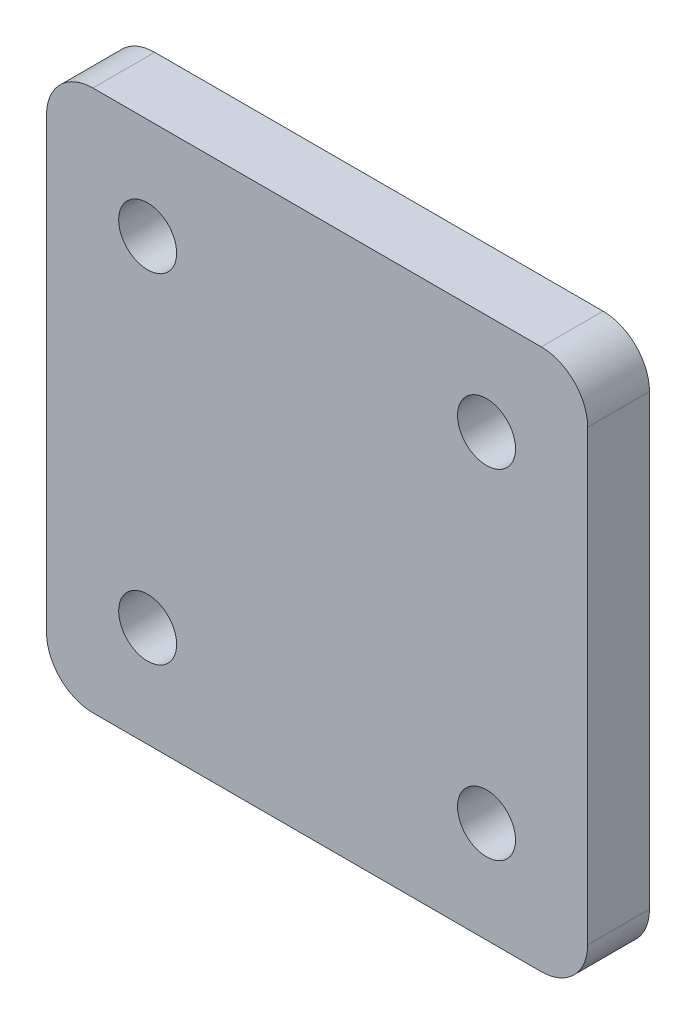
ISO-10303-21;
HEADER;
FILE_DESCRIPTION(('STEP AP214'),'2;1');
FILE_NAME('part.step','',(''),(''),'','','');
FILE_SCHEMA(('AUTOMOTIVE_DESIGN { 1 0 10303 214 1 1 1 1 }'));
ENDSEC;
DATA;
#1=APPLICATION_CONTEXT('core data for automotive mechanical design processes');
#2=APPLICATION_PROTOCOL_DEFINITION('international standard','automotive_design',2000,#1);
#3=PRODUCT_CONTEXT('',#1,'mechanical');
#4=PRODUCT('Part','Part','',(#3));
#5=PRODUCT_RELATED_PRODUCT_CATEGORY('part','',(#4));
#6=PRODUCT_DEFINITION_FORMATION('','',#4);
#7=PRODUCT_DEFINITION_CONTEXT('part definition',#1,'design');
#8=PRODUCT_DEFINITION('design','',#6,#7);
#9=PRODUCT_DEFINITION_SHAPE('','',#8);
#10=(LENGTH_UNIT() NAMED_UNIT(*) SI_UNIT(.MILLI.,.METRE.));
#11=(NAMED_UNIT(*) PLANE_ANGLE_UNIT() SI_UNIT($,.RADIAN.));
#12=(NAMED_UNIT(*) SI_UNIT($,.STERADIAN.) SOLID_ANGLE_UNIT());
#13=UNCERTAINTY_MEASURE_WITH_UNIT(LENGTH_MEASURE(1.E-05),#10,'distance_accuracy_value','');
#14=(GEOMETRIC_REPRESENTATION_CONTEXT(3) GLOBAL_UNCERTAINTY_ASSIGNED_CONTEXT((#13)) GLOBAL_UNIT_ASSIGNED_CONTEXT((#10,
#11,#12)) REPRESENTATION_CONTEXT('',''));
#15=CARTESIAN_POINT('',(0.,0.,0.));
#16=DIRECTION('',(0.,0.,1.));
#17=DIRECTION('',(1.,0.,0.));
#18=AXIS2_PLACEMENT_3D('',#15,#16,#17);
#19=CARTESIAN_POINT('',(-14.5000000000002,-14.5,4.));
#20=DIRECTION('',(0.,0.,-1.));
#21=DIRECTION('',(-1.,0.,0.));
#22=AXIS2_PLACEMENT_3D('',#19,#20,#21);
#23=CYLINDRICAL_SURFACE('',#22,3.);
#24=CARTESIAN_POINT('',(-14.5,-14.5,0.));
#25=DIRECTION('',(0.,0.,1.));
#26=DIRECTION('',(1.,0.,0.));
#27=AXIS2_PLACEMENT_3D('',#24,#25,#26);
#28=CIRCLE('',#27,3.);
#29=CARTESIAN_POINT('',(-17.5,-14.5,0.));
#30=VERTEX_POINT('',#29);
#31=CARTESIAN_POINT('',(-14.5,-17.5,0.));
#32=VERTEX_POINT('',#31);
#33=EDGE_CURVE('E132',#30,#32,#28,.T.);
#34=ORIENTED_EDGE('',*,*,#33,.T.);
#35=DIRECTION('',(0.,0.,-1.));
#36=VECTOR('',#35,1.);
#37=CARTESIAN_POINT('',(-14.5000000000002,-17.5,4.));
#38=LINE('',#37,#36);
#39=CARTESIAN_POINT('',(-14.5000000000002,-17.5,4.));
#40=VERTEX_POINT('',#39);
#41=EDGE_CURVE('E11',#40,#32,#38,.T.);
#42=ORIENTED_EDGE('',*,*,#41,.F.);
#43=CARTESIAN_POINT('',(-14.5000000000002,-14.5,4.));
#44=DIRECTION('',(0.,0.,1.));
#45=DIRECTION('',(1.,0.,0.));
#46=AXIS2_PLACEMENT_3D('',#43,#44,#45);
#47=CIRCLE('',#46,3.);
#48=CARTESIAN_POINT('',(-17.5000000000001,-14.5,4.));
#49=VERTEX_POINT('',#48);
#50=EDGE_CURVE('E147',#49,#40,#47,.T.);
#51=ORIENTED_EDGE('',*,*,#50,.F.);
#52=DIRECTION('',(0.,0.,-1.));
#53=VECTOR('',#52,1.);
#54=CARTESIAN_POINT('',(-17.5000000000001,-14.5,4.));
#55=LINE('',#54,#53);
#56=EDGE_CURVE('E128',#49,#30,#55,.T.);
#57=ORIENTED_EDGE('',*,*,#56,.T.);
#58=EDGE_LOOP('',(#34,#42,#51,#57));
#59=FACE_BOUND('',#58,.T.);
#60=ADVANCED_FACE('F36',(#59),#23,.T.);
#61=CARTESIAN_POINT('',(-14.5000000000002,-17.5,4.));
#62=DIRECTION('',(0.,1.,0.));
#63=DIRECTION('',(-1.,0.,0.));
#64=AXIS2_PLACEMENT_3D('',#61,#62,#63);
#65=PLANE('',#64);
#66=DIRECTION('',(1.,0.,0.));
#67=VECTOR('',#66,1.);
#68=CARTESIAN_POINT('',(-14.5,-17.5,0.));
#69=LINE('',#68,#67);
#70=CARTESIAN_POINT('',(14.5,-17.5,0.));
#71=VERTEX_POINT('',#70);
#72=EDGE_CURVE('E135',#32,#71,#69,.T.);
#73=ORIENTED_EDGE('',*,*,#72,.T.);
#74=DIRECTION('',(0.,0.,-1.));
#75=VECTOR('',#74,1.);
#76=CARTESIAN_POINT('',(14.4999999999998,-17.5,3.99999999999999));
#77=LINE('',#76,#75);
#78=CARTESIAN_POINT('',(14.4999999999998,-17.5,3.99999999999999));
#79=VERTEX_POINT('',#78);
#80=EDGE_CURVE('E44',#79,#71,#77,.T.);
#81=ORIENTED_EDGE('',*,*,#80,.F.);
#82=DIRECTION('',(1.,0.,0.));
#83=VECTOR('',#82,1.);
#84=CARTESIAN_POINT('',(-14.5000000000002,-17.5,4.));
#85=LINE('',#84,#83);
#86=EDGE_CURVE('E95',#40,#79,#85,.T.);
#87=ORIENTED_EDGE('',*,*,#86,.F.);
#88=ORIENTED_EDGE('',*,*,#41,.T.);
#89=EDGE_LOOP('',(#73,#81,#87,#88));
#90=FACE_BOUND('',#89,.T.);
#91=ADVANCED_FACE('F228',(#90),#65,.F.);
#92=CARTESIAN_POINT('',(14.4999999999998,-14.5,3.99999999999996));
#93=DIRECTION('',(0.,0.,-1.));
#94=DIRECTION('',(-1.,0.,0.));
#95=AXIS2_PLACEMENT_3D('',#92,#93,#94);
#96=CYLINDRICAL_SURFACE('',#95,3.);
#97=CARTESIAN_POINT('',(14.5,-14.5,0.));
#98=DIRECTION('',(0.,0.,1.));
#99=DIRECTION('',(1.,0.,0.));
#100=AXIS2_PLACEMENT_3D('',#97,#98,#99);
#101=CIRCLE('',#100,3.);
#102=CARTESIAN_POINT('',(17.5,-14.5,0.));
#103=VERTEX_POINT('',#102);
#104=EDGE_CURVE('E138',#71,#103,#101,.T.);
#105=ORIENTED_EDGE('',*,*,#104,.T.);
#106=DIRECTION('',(0.,0.,-1.));
#107=VECTOR('',#106,1.);
#108=CARTESIAN_POINT('',(17.4999999999999,-14.5,3.99999999999996));
#109=LINE('',#108,#107);
#110=CARTESIAN_POINT('',(17.4999999999999,-14.5,3.99999999999996));
#111=VERTEX_POINT('',#110);
#112=EDGE_CURVE('E154',#111,#103,#109,.T.);
#113=ORIENTED_EDGE('',*,*,#112,.F.);
#114=CARTESIAN_POINT('',(14.4999999999998,-14.5,3.99999999999996));
#115=DIRECTION('',(0.,0.,1.));
#116=DIRECTION('',(1.,0.,0.));
#117=AXIS2_PLACEMENT_3D('',#114,#115,#116);
#118=CIRCLE('',#117,3.);
#119=EDGE_CURVE('E162',#79,#111,#118,.T.);
#120=ORIENTED_EDGE('',*,*,#119,.F.);
#121=ORIENTED_EDGE('',*,*,#80,.T.);
#122=EDGE_LOOP('',(#105,#113,#120,#121));
#123=FACE_BOUND('',#122,.T.);
#124=ADVANCED_FACE('F160',(#123),#96,.T.);
#125=CARTESIAN_POINT('',(17.4999999999999,-14.5,3.99999999999996));
#126=DIRECTION('',(-1.,0.,0.));
#127=DIRECTION('',(0.,0.,1.));
#128=AXIS2_PLACEMENT_3D('',#125,#126,#127);
#129=PLANE('',#128);
#130=DIRECTION('',(0.,1.,0.));
#131=VECTOR('',#130,1.);
#132=CARTESIAN_POINT('',(17.5,-14.5,0.));
#133=LINE('',#132,#131);
#134=CARTESIAN_POINT('',(17.5,14.5,0.));
#135=VERTEX_POINT('',#134);
#136=EDGE_CURVE('E140',#103,#135,#133,.T.);
#137=ORIENTED_EDGE('',*,*,#136,.T.);
#138=DIRECTION('',(0.,0.,-1.));
#139=VECTOR('',#138,1.);
#140=CARTESIAN_POINT('',(17.4999999999999,14.5,3.99999999999998));
#141=LINE('',#140,#139);
#142=CARTESIAN_POINT('',(17.4999999999999,14.5,3.99999999999998));
#143=VERTEX_POINT('',#142);
#144=EDGE_CURVE('E151',#143,#135,#141,.T.);
#145=ORIENTED_EDGE('',*,*,#144,.F.);
#146=DIRECTION('',(0.,1.,0.));
#147=VECTOR('',#146,1.);
#148=CARTESIAN_POINT('',(17.4999999999999,-14.5,3.99999999999996));
#149=LINE('',#148,#147);
#150=EDGE_CURVE('E174',#111,#143,#149,.T.);
#151=ORIENTED_EDGE('',*,*,#150,.F.);
#152=ORIENTED_EDGE('',*,*,#112,.T.);
#153=EDGE_LOOP('',(#137,#145,#151,#152));
#154=FACE_BOUND('',#153,.T.);
#155=ADVANCED_FACE('F170',(#154),#129,.F.);
#156=CARTESIAN_POINT('',(14.4999999999998,14.5,3.99999999999998));
#157=DIRECTION('',(0.,0.,-1.));
#158=DIRECTION('',(-1.,0.,0.));
#159=AXIS2_PLACEMENT_3D('',#156,#157,#158);
#160=CYLINDRICAL_SURFACE('',#159,3.);
#161=CARTESIAN_POINT('',(14.5,14.5,0.));
#162=DIRECTION('',(0.,0.,1.));
#163=DIRECTION('',(1.,0.,0.));
#164=AXIS2_PLACEMENT_3D('',#161,#162,#163);
#165=CIRCLE('',#164,3.);
#166=CARTESIAN_POINT('',(14.4999999999998,17.5,0.));
#167=VERTEX_POINT('',#166);
#168=EDGE_CURVE('E142',#135,#167,#165,.T.);
#169=ORIENTED_EDGE('',*,*,#168,.T.);
#170=DIRECTION('',(0.,0.,-1.));
#171=VECTOR('',#170,1.);
#172=CARTESIAN_POINT('',(14.4999999999997,17.5,3.99999999999998));
#173=LINE('',#172,#171);
#174=CARTESIAN_POINT('',(14.4999999999997,17.5,3.99999999999998));
#175=VERTEX_POINT('',#174);
#176=EDGE_CURVE('E123',#175,#167,#173,.T.);
#177=ORIENTED_EDGE('',*,*,#176,.F.);
#178=CARTESIAN_POINT('',(14.4999999999998,14.5,3.99999999999998));
#179=DIRECTION('',(0.,0.,1.));
#180=DIRECTION('',(1.,0.,0.));
#181=AXIS2_PLACEMENT_3D('',#178,#179,#180);
#182=CIRCLE('',#181,3.);
#183=EDGE_CURVE('E114',#143,#175,#182,.T.);
#184=ORIENTED_EDGE('',*,*,#183,.F.);
#185=ORIENTED_EDGE('',*,*,#144,.T.);
#186=EDGE_LOOP('',(#169,#177,#184,#185));
#187=FACE_BOUND('',#186,.T.);
#188=ADVANCED_FACE('F173',(#187),#160,.T.);
#189=CARTESIAN_POINT('',(14.4999999999997,17.5,3.99999999999998));
#190=DIRECTION('',(0.,-1.,0.));
#191=DIRECTION('',(1.,0.,0.));
#192=AXIS2_PLACEMENT_3D('',#189,#190,#191);
#193=PLANE('',#192);
#194=DIRECTION('',(-1.,0.,0.));
#195=VECTOR('',#194,1.);
#196=CARTESIAN_POINT('',(14.4999999999998,17.5,0.));
#197=LINE('',#196,#195);
#198=CARTESIAN_POINT('',(-14.5000000000002,17.5,0.));
#199=VERTEX_POINT('',#198);
#200=EDGE_CURVE('E122',#167,#199,#197,.T.);
#201=ORIENTED_EDGE('',*,*,#200,.T.);
#202=DIRECTION('',(0.,0.,-1.));
#203=VECTOR('',#202,1.);
#204=CARTESIAN_POINT('',(-14.5000000000003,17.5,4.00000000000002));
#205=LINE('',#204,#203);
#206=CARTESIAN_POINT('',(-14.5000000000003,17.5,4.00000000000002));
#207=VERTEX_POINT('',#206);
#208=EDGE_CURVE('E119',#207,#199,#205,.T.);
#209=ORIENTED_EDGE('',*,*,#208,.F.);
#210=DIRECTION('',(-1.,0.,0.));
#211=VECTOR('',#210,1.);
#212=CARTESIAN_POINT('',(14.4999999999997,17.5,3.99999999999998));
#213=LINE('',#212,#211);
#214=EDGE_CURVE('E108',#175,#207,#213,.T.);
#215=ORIENTED_EDGE('',*,*,#214,.F.);
#216=ORIENTED_EDGE('',*,*,#176,.T.);
#217=EDGE_LOOP('',(#201,#209,#215,#216));
#218=FACE_BOUND('',#217,.T.);
#219=ADVANCED_FACE('F120',(#218),#193,.F.);
#220=CARTESIAN_POINT('',(-14.5000000000001,14.5,3.99999999999999));
#221=DIRECTION('',(0.,0.,-1.));
#222=DIRECTION('',(-1.,0.,0.));
#223=AXIS2_PLACEMENT_3D('',#220,#221,#222);
#224=CYLINDRICAL_SURFACE('',#223,3.);
#225=CARTESIAN_POINT('',(-14.5,14.5,0.));
#226=DIRECTION('',(0.,0.,1.));
#227=DIRECTION('',(1.,0.,0.));
#228=AXIS2_PLACEMENT_3D('',#225,#226,#227);
#229=CIRCLE('',#228,3.);
#230=CARTESIAN_POINT('',(-17.5,14.5,0.));
#231=VERTEX_POINT('',#230);
#232=EDGE_CURVE('E81',#199,#231,#229,.T.);
#233=ORIENTED_EDGE('',*,*,#232,.T.);
#234=DIRECTION('',(0.,0.,-1.));
#235=VECTOR('',#234,1.);
#236=CARTESIAN_POINT('',(-17.5000000000001,14.5,3.99999999999999));
#237=LINE('',#236,#235);
#238=CARTESIAN_POINT('',(-17.5000000000001,14.5,3.99999999999999));
#239=VERTEX_POINT('',#238);
#240=EDGE_CURVE('E124',#239,#231,#237,.T.);
#241=ORIENTED_EDGE('',*,*,#240,.F.);
#242=CARTESIAN_POINT('',(-14.5000000000001,14.5,3.99999999999999));
#243=DIRECTION('',(0.,0.,1.));
#244=DIRECTION('',(1.,0.,0.));
#245=AXIS2_PLACEMENT_3D('',#242,#243,#244);
#246=CIRCLE('',#245,3.);
#247=EDGE_CURVE('E112',#207,#239,#246,.T.);
#248=ORIENTED_EDGE('',*,*,#247,.F.);
#249=ORIENTED_EDGE('',*,*,#208,.T.);
#250=EDGE_LOOP('',(#233,#241,#248,#249));
#251=FACE_BOUND('',#250,.T.);
#252=ADVANCED_FACE('F126',(#251),#224,.T.);
#253=CARTESIAN_POINT('',(-17.5000000000001,14.5,3.99999999999999));
#254=DIRECTION('',(1.,0.,0.));
#255=DIRECTION('',(0.,0.,-1.));
#256=AXIS2_PLACEMENT_3D('',#253,#254,#255);
#257=PLANE('',#256);
#258=DIRECTION('',(0.,-1.,0.));
#259=VECTOR('',#258,1.);
#260=CARTESIAN_POINT('',(-17.5,14.5,0.));
#261=LINE('',#260,#259);
#262=EDGE_CURVE('E87',#231,#30,#261,.T.);
#263=ORIENTED_EDGE('',*,*,#262,.T.);
#264=ORIENTED_EDGE('',*,*,#56,.F.);
#265=DIRECTION('',(0.,-1.,0.));
#266=VECTOR('',#265,1.);
#267=CARTESIAN_POINT('',(-17.5000000000001,14.5,3.99999999999999));
#268=LINE('',#267,#266);
#269=EDGE_CURVE('E52',#239,#49,#268,.T.);
#270=ORIENTED_EDGE('',*,*,#269,.F.);
#271=ORIENTED_EDGE('',*,*,#240,.T.);
#272=EDGE_LOOP('',(#263,#264,#270,#271));
#273=FACE_BOUND('',#272,.T.);
#274=ADVANCED_FACE('F235',(#273),#257,.F.);
#275=CARTESIAN_POINT('',(-14.5000000000002,-14.5,4.));
#276=DIRECTION('',(0.,0.,1.));
#277=DIRECTION('',(1.,0.,0.));
#278=AXIS2_PLACEMENT_3D('',#275,#276,#277);
#279=PLANE('',#278);
#280=CARTESIAN_POINT('',(10.9601551083913,10.9601551083915,3.99999999999999));
#281=DIRECTION('',(0.,0.,1.));
#282=DIRECTION('',(1.,0.,0.));
#283=AXIS2_PLACEMENT_3D('',#280,#281,#282);
#284=CIRCLE('',#283,1.875);
#285=CARTESIAN_POINT('',(12.8351551083913,10.9601551083915,3.99999999999999));
#286=VERTEX_POINT('',#285);
#287=EDGE_CURVE('E197',#286,#286,#284,.T.);
#288=ORIENTED_EDGE('',*,*,#287,.F.);
#289=EDGE_LOOP('',(#288));
#290=FACE_BOUND('',#289,.T.);
#291=CARTESIAN_POINT('',(-10.9601551083917,10.9601551083915,4.00000000000002));
#292=DIRECTION('',(0.,0.,1.));
#293=DIRECTION('',(1.,0.,0.));
#294=AXIS2_PLACEMENT_3D('',#291,#292,#293);
#295=CIRCLE('',#294,1.87499999999999);
#296=CARTESIAN_POINT('',(-9.08515510839166,10.9601551083915,4.00000000000002));
#297=VERTEX_POINT('',#296);
#298=EDGE_CURVE('E191',#297,#297,#295,.T.);
#299=ORIENTED_EDGE('',*,*,#298,.F.);
#300=EDGE_LOOP('',(#299));
#301=FACE_BOUND('',#300,.T.);
#302=CARTESIAN_POINT('',(-10.9601551083917,-10.9601551083915,4.00000000000007));
#303=DIRECTION('',(0.,0.,1.));
#304=DIRECTION('',(1.,0.,0.));
#305=AXIS2_PLACEMENT_3D('',#302,#303,#304);
#306=CIRCLE('',#305,1.87499999999999);
#307=CARTESIAN_POINT('',(-9.08515510839166,-10.9601551083915,4.00000000000007));
#308=VERTEX_POINT('',#307);
#309=EDGE_CURVE('E185',#308,#308,#306,.T.);
#310=ORIENTED_EDGE('',*,*,#309,.F.);
#311=EDGE_LOOP('',(#310));
#312=FACE_BOUND('',#311,.T.);
#313=CARTESIAN_POINT('',(10.9601551083913,-10.9601551083915,4.00000000000006));
#314=DIRECTION('',(0.,0.,1.));
#315=DIRECTION('',(1.,0.,0.));
#316=AXIS2_PLACEMENT_3D('',#313,#314,#315);
#317=CIRCLE('',#316,1.875);
#318=CARTESIAN_POINT('',(12.8351551083913,-10.9601551083915,4.00000000000006));
#319=VERTEX_POINT('',#318);
#320=EDGE_CURVE('E136',#319,#319,#317,.T.);
#321=ORIENTED_EDGE('',*,*,#320,.F.);
#322=EDGE_LOOP('',(#321));
#323=FACE_BOUND('',#322,.T.);
#324=ORIENTED_EDGE('',*,*,#50,.T.);
#325=ORIENTED_EDGE('',*,*,#86,.T.);
#326=ORIENTED_EDGE('',*,*,#119,.T.);
#327=ORIENTED_EDGE('',*,*,#150,.T.);
#328=ORIENTED_EDGE('',*,*,#183,.T.);
#329=ORIENTED_EDGE('',*,*,#214,.T.);
#330=ORIENTED_EDGE('',*,*,#247,.T.);
#331=ORIENTED_EDGE('',*,*,#269,.T.);
#332=EDGE_LOOP('',(#324,#325,#326,#327,#328,#329,#330,#331));
#333=FACE_BOUND('',#332,.T.);
#334=ADVANCED_FACE('F110',(#290,#301,#312,#323,#333),#279,.T.);
#335=CARTESIAN_POINT('',(-14.5,-14.5,0.));
#336=DIRECTION('',(0.,0.,1.));
#337=DIRECTION('',(1.,0.,0.));
#338=AXIS2_PLACEMENT_3D('',#335,#336,#337);
#339=PLANE('',#338);
#340=CARTESIAN_POINT('',(10.9601551083915,10.9601551083915,0.));
#341=DIRECTION('',(0.,0.,-1.));
#342=DIRECTION('',(-1.,0.,0.));
#343=AXIS2_PLACEMENT_3D('',#340,#341,#342);
#344=CIRCLE('',#343,1.875);
#345=CARTESIAN_POINT('',(9.08515510839149,10.9601551083915,0.));
#346=VERTEX_POINT('',#345);
#347=EDGE_CURVE('E200',#346,#346,#344,.T.);
#348=ORIENTED_EDGE('',*,*,#347,.F.);
#349=EDGE_LOOP('',(#348));
#350=FACE_BOUND('',#349,.T.);
#351=CARTESIAN_POINT('',(-10.9601551083915,10.9601551083915,0.));
#352=DIRECTION('',(0.,0.,-1.));
#353=DIRECTION('',(-1.,0.,0.));
#354=AXIS2_PLACEMENT_3D('',#351,#352,#353);
#355=CIRCLE('',#354,1.87499999999999);
#356=CARTESIAN_POINT('',(-12.8351551083915,10.9601551083915,0.));
#357=VERTEX_POINT('',#356);
#358=EDGE_CURVE('E194',#357,#357,#355,.T.);
#359=ORIENTED_EDGE('',*,*,#358,.F.);
#360=EDGE_LOOP('',(#359));
#361=FACE_BOUND('',#360,.T.);
#362=CARTESIAN_POINT('',(-10.9601551083915,-10.9601551083915,0.));
#363=DIRECTION('',(0.,0.,-1.));
#364=DIRECTION('',(-1.,0.,0.));
#365=AXIS2_PLACEMENT_3D('',#362,#363,#364);
#366=CIRCLE('',#365,1.87499999999999);
#367=CARTESIAN_POINT('',(-12.8351551083915,-10.9601551083915,0.));
#368=VERTEX_POINT('',#367);
#369=EDGE_CURVE('E188',#368,#368,#366,.T.);
#370=ORIENTED_EDGE('',*,*,#369,.F.);
#371=EDGE_LOOP('',(#370));
#372=FACE_BOUND('',#371,.T.);
#373=CARTESIAN_POINT('',(10.9601551083915,-10.9601551083915,0.));
#374=DIRECTION('',(0.,0.,-1.));
#375=DIRECTION('',(-1.,0.,0.));
#376=AXIS2_PLACEMENT_3D('',#373,#374,#375);
#377=CIRCLE('',#376,1.875);
#378=CARTESIAN_POINT('',(9.08515510839149,-10.9601551083915,0.));
#379=VERTEX_POINT('',#378);
#380=EDGE_CURVE('E182',#379,#379,#377,.T.);
#381=ORIENTED_EDGE('',*,*,#380,.F.);
#382=EDGE_LOOP('',(#381));
#383=FACE_BOUND('',#382,.T.);
#384=ORIENTED_EDGE('',*,*,#33,.F.);
#385=ORIENTED_EDGE('',*,*,#262,.F.);
#386=ORIENTED_EDGE('',*,*,#232,.F.);
#387=ORIENTED_EDGE('',*,*,#200,.F.);
#388=ORIENTED_EDGE('',*,*,#168,.F.);
#389=ORIENTED_EDGE('',*,*,#136,.F.);
#390=ORIENTED_EDGE('',*,*,#104,.F.);
#391=ORIENTED_EDGE('',*,*,#72,.F.);
#392=EDGE_LOOP('',(#384,#385,#386,#387,#388,#389,#390,#391));
#393=FACE_BOUND('',#392,.T.);
#394=ADVANCED_FACE('F166',(#350,#361,#372,#383,#393),#339,.F.);
#395=CARTESIAN_POINT('',(10.9601551083915,-10.9601551083915,0.));
#396=DIRECTION('',(0.,0.,-1.));
#397=DIRECTION('',(-1.,0.,0.));
#398=AXIS2_PLACEMENT_3D('',#395,#396,#397);
#399=CYLINDRICAL_SURFACE('',#398,1.875);
#400=ORIENTED_EDGE('',*,*,#320,.T.);
#401=EDGE_LOOP('',(#400));
#402=FACE_BOUND('',#401,.T.);
#403=ORIENTED_EDGE('',*,*,#380,.T.);
#404=EDGE_LOOP('',(#403));
#405=FACE_BOUND('',#404,.T.);
#406=ADVANCED_FACE('F208',(#402,#405),#399,.F.);
#407=CARTESIAN_POINT('',(-10.9601551083915,-10.9601551083915,0.));
#408=DIRECTION('',(0.,0.,-1.));
#409=DIRECTION('',(-1.,0.,0.));
#410=AXIS2_PLACEMENT_3D('',#407,#408,#409);
#411=CYLINDRICAL_SURFACE('',#410,1.87499999999999);
#412=ORIENTED_EDGE('',*,*,#309,.T.);
#413=EDGE_LOOP('',(#412));
#414=FACE_BOUND('',#413,.T.);
#415=ORIENTED_EDGE('',*,*,#369,.T.);
#416=EDGE_LOOP('',(#415));
#417=FACE_BOUND('',#416,.T.);
#418=ADVANCED_FACE('F217',(#414,#417),#411,.F.);
#419=CARTESIAN_POINT('',(-10.9601551083915,10.9601551083915,0.));
#420=DIRECTION('',(0.,0.,-1.));
#421=DIRECTION('',(-1.,0.,0.));
#422=AXIS2_PLACEMENT_3D('',#419,#420,#421);
#423=CYLINDRICAL_SURFACE('',#422,1.87499999999999);
#424=ORIENTED_EDGE('',*,*,#298,.T.);
#425=EDGE_LOOP('',(#424));
#426=FACE_BOUND('',#425,.T.);
#427=ORIENTED_EDGE('',*,*,#358,.T.);
#428=EDGE_LOOP('',(#427));
#429=FACE_BOUND('',#428,.T.);
#430=ADVANCED_FACE('F223',(#426,#429),#423,.F.);
#431=CARTESIAN_POINT('',(10.9601551083915,10.9601551083915,0.));
#432=DIRECTION('',(0.,0.,-1.));
#433=DIRECTION('',(-1.,0.,0.));
#434=AXIS2_PLACEMENT_3D('',#431,#432,#433);
#435=CYLINDRICAL_SURFACE('',#434,1.875);
#436=ORIENTED_EDGE('',*,*,#287,.T.);
#437=EDGE_LOOP('',(#436));
#438=FACE_BOUND('',#437,.T.);
#439=ORIENTED_EDGE('',*,*,#347,.T.);
#440=EDGE_LOOP('',(#439));
#441=FACE_BOUND('',#440,.T.);
#442=ADVANCED_FACE('F204',(#438,#441),#435,.F.);
#443=CLOSED_SHELL('',(#60,#91,#124,#155,#188,#219,#252,#274,#334,#394,#406,#418,#430,#442));
#444=MANIFOLD_SOLID_BREP('B2',#443);
#445=ADVANCED_BREP_SHAPE_REPRESENTATION('',(#18,#444),#14);
#446=SHAPE_DEFINITION_REPRESENTATION(#9,#445);
ENDSEC;
END-ISO-10303-21;
